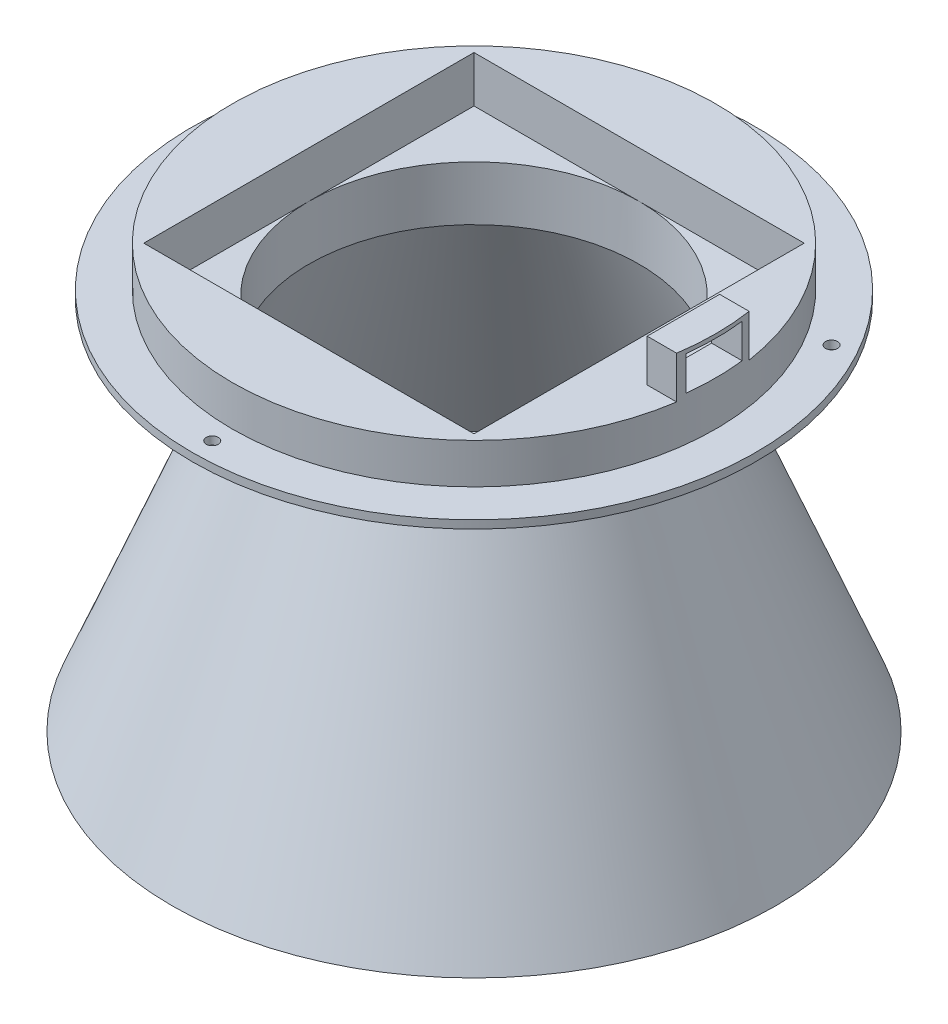
ISO-10303-21;
HEADER;
FILE_DESCRIPTION(('STEP AP214'),'2;1');
FILE_NAME('part.step','',(''),(''),'','','');
FILE_SCHEMA(('AUTOMOTIVE_DESIGN { 1 0 10303 214 1 1 1 1 }'));
ENDSEC;
DATA;
#1=APPLICATION_CONTEXT('core data for automotive mechanical design processes');
#2=APPLICATION_PROTOCOL_DEFINITION('international standard','automotive_design',2000,#1);
#3=PRODUCT_CONTEXT('',#1,'mechanical');
#4=PRODUCT('Part','Part','',(#3));
#5=PRODUCT_RELATED_PRODUCT_CATEGORY('part','',(#4));
#6=PRODUCT_DEFINITION_FORMATION('','',#4);
#7=PRODUCT_DEFINITION_CONTEXT('part definition',#1,'design');
#8=PRODUCT_DEFINITION('design','',#6,#7);
#9=PRODUCT_DEFINITION_SHAPE('','',#8);
#10=(LENGTH_UNIT() NAMED_UNIT(*) SI_UNIT(.MILLI.,.METRE.));
#11=(NAMED_UNIT(*) PLANE_ANGLE_UNIT() SI_UNIT($,.RADIAN.));
#12=(NAMED_UNIT(*) SI_UNIT($,.STERADIAN.) SOLID_ANGLE_UNIT());
#13=UNCERTAINTY_MEASURE_WITH_UNIT(LENGTH_MEASURE(1.E-05),#10,'distance_accuracy_value','');
#14=(GEOMETRIC_REPRESENTATION_CONTEXT(3) GLOBAL_UNCERTAINTY_ASSIGNED_CONTEXT((#13)) GLOBAL_UNIT_ASSIGNED_CONTEXT((#10,
#11,#12)) REPRESENTATION_CONTEXT('',''));
#15=CARTESIAN_POINT('',(0.,0.,0.));
#16=DIRECTION('',(0.,0.,1.));
#17=DIRECTION('',(1.,0.,0.));
#18=AXIS2_PLACEMENT_3D('',#15,#16,#17);
#19=CARTESIAN_POINT('',(-26.9016428172304,46.9761170199418,0.));
#20=DIRECTION('',(0.,1.,0.));
#21=DIRECTION('',(0.,0.,1.));
#22=AXIS2_PLACEMENT_3D('',#19,#20,#21);
#23=CYLINDRICAL_SURFACE('',#22,41.);
#24=CARTESIAN_POINT('',(-26.9016428172304,46.9761170199418,0.));
#25=DIRECTION('',(0.,1.,0.));
#26=DIRECTION('',(0.,0.,1.));
#27=AXIS2_PLACEMENT_3D('',#24,#25,#26);
#28=CIRCLE('',#27,41.);
#29=CARTESIAN_POINT('',(-26.9016428172304,46.9761170199418,41.));
#30=VERTEX_POINT('',#29);
#31=EDGE_CURVE('E224',#30,#30,#28,.T.);
#32=ORIENTED_EDGE('',*,*,#31,.F.);
#33=EDGE_LOOP('',(#32));
#34=FACE_BOUND('',#33,.T.);
#35=CARTESIAN_POINT('',(-26.9016428172304,60.4761170199418,0.));
#36=DIRECTION('',(0.,1.,0.));
#37=DIRECTION('',(0.,0.,1.));
#38=AXIS2_PLACEMENT_3D('',#35,#36,#37);
#39=CIRCLE('',#38,41.);
#40=CARTESIAN_POINT('',(-67.9016428172304,60.4761170199418,0.));
#41=VERTEX_POINT('',#40);
#42=CARTESIAN_POINT('',(-26.9016428172304,60.4761170199418,41.));
#43=VERTEX_POINT('',#42);
#44=EDGE_CURVE('E44',#41,#43,#39,.T.);
#45=ORIENTED_EDGE('',*,*,#44,.T.);
#46=CARTESIAN_POINT('',(14.0983571827696,60.4761170199418,0.));
#47=VERTEX_POINT('',#46);
#48=EDGE_CURVE('E11',#43,#47,#39,.T.);
#49=ORIENTED_EDGE('',*,*,#48,.T.);
#50=CARTESIAN_POINT('',(-26.9016428172304,60.4761170199418,-41.));
#51=VERTEX_POINT('',#50);
#52=EDGE_CURVE('E42',#47,#51,#39,.T.);
#53=ORIENTED_EDGE('',*,*,#52,.T.);
#54=EDGE_CURVE('E257',#51,#41,#39,.T.);
#55=ORIENTED_EDGE('',*,*,#54,.T.);
#56=EDGE_LOOP('',(#45,#49,#53,#55));
#57=FACE_BOUND('',#56,.T.);
#58=ADVANCED_FACE('F33',(#34,#57),#23,.F.);
#59=CARTESIAN_POINT('',(-26.9016428172304,-33.0238829800582,0.));
#60=DIRECTION('',(0.,-1.,0.));
#61=DIRECTION('',(0.,0.,-1.));
#62=AXIS2_PLACEMENT_3D('',#59,#60,#61);
#63=CONICAL_SURFACE('',#62,73.,0.380506377112365);
#64=ORIENTED_EDGE('',*,*,#31,.T.);
#65=EDGE_LOOP('',(#64));
#66=FACE_BOUND('',#65,.T.);
#67=CARTESIAN_POINT('',(-26.9016428172304,-33.0238829800582,0.));
#68=DIRECTION('',(0.,1.,0.));
#69=DIRECTION('',(0.,0.,1.));
#70=AXIS2_PLACEMENT_3D('',#67,#68,#69);
#71=CIRCLE('',#70,73.);
#72=CARTESIAN_POINT('',(-26.9016428172304,-33.0238829800582,73.));
#73=VERTEX_POINT('',#72);
#74=EDGE_CURVE('E254',#73,#73,#71,.T.);
#75=ORIENTED_EDGE('',*,*,#74,.F.);
#76=EDGE_LOOP('',(#75));
#77=FACE_BOUND('',#76,.T.);
#78=ADVANCED_FACE('F35',(#66,#77),#63,.F.);
#79=CARTESIAN_POINT('',(-101.90164281723,-33.0238829800582,0.));
#80=DIRECTION('',(0.,-1.,0.));
#81=DIRECTION('',(0.,0.,-1.));
#82=AXIS2_PLACEMENT_3D('',#79,#80,#81);
#83=PLANE('',#82);
#84=ORIENTED_EDGE('',*,*,#74,.T.);
#85=EDGE_LOOP('',(#84));
#86=FACE_BOUND('',#85,.T.);
#87=CARTESIAN_POINT('',(-26.9016428172304,-33.0238829800582,0.));
#88=DIRECTION('',(0.,1.,0.));
#89=DIRECTION('',(0.,0.,1.));
#90=AXIS2_PLACEMENT_3D('',#87,#88,#89);
#91=CIRCLE('',#90,75.);
#92=CARTESIAN_POINT('',(-26.9016428172304,-33.0238829800582,75.));
#93=VERTEX_POINT('',#92);
#94=EDGE_CURVE('E251',#93,#93,#91,.T.);
#95=ORIENTED_EDGE('',*,*,#94,.F.);
#96=EDGE_LOOP('',(#95));
#97=FACE_BOUND('',#96,.T.);
#98=ADVANCED_FACE('F342',(#86,#97),#83,.T.);
#99=CARTESIAN_POINT('',(-26.9016428172304,46.9761170199418,0.));
#100=DIRECTION('',(0.,-1.,0.));
#101=DIRECTION('',(0.,0.,-1.));
#102=AXIS2_PLACEMENT_3D('',#99,#100,#101);
#103=CONICAL_SURFACE('',#102,43.,0.380506377112365);
#104=ORIENTED_EDGE('',*,*,#94,.T.);
#105=EDGE_LOOP('',(#104));
#106=FACE_BOUND('',#105,.T.);
#107=CARTESIAN_POINT('',(-26.9016428172304,46.9761170199418,0.));
#108=DIRECTION('',(0.,1.,0.));
#109=DIRECTION('',(0.,0.,1.));
#110=AXIS2_PLACEMENT_3D('',#107,#108,#109);
#111=CIRCLE('',#110,43.);
#112=CARTESIAN_POINT('',(-26.9016428172304,46.9761170199418,43.));
#113=VERTEX_POINT('',#112);
#114=EDGE_CURVE('E248',#113,#113,#111,.T.);
#115=ORIENTED_EDGE('',*,*,#114,.F.);
#116=EDGE_LOOP('',(#115));
#117=FACE_BOUND('',#116,.T.);
#118=ADVANCED_FACE('F366',(#106,#117),#103,.T.);
#119=CARTESIAN_POINT('',(-26.9016428172304,59.9761170199418,0.));
#120=DIRECTION('',(0.,1.,0.));
#121=DIRECTION('',(0.,0.,1.));
#122=AXIS2_PLACEMENT_3D('',#119,#120,#121);
#123=CONICAL_SURFACE('',#122,60.,0.917949695694122);
#124=ORIENTED_EDGE('',*,*,#114,.T.);
#125=EDGE_LOOP('',(#124));
#126=FACE_BOUND('',#125,.T.);
#127=CARTESIAN_POINT('',(-26.9016428172304,59.9761170199418,0.));
#128=DIRECTION('',(0.,1.,0.));
#129=DIRECTION('',(0.,0.,1.));
#130=AXIS2_PLACEMENT_3D('',#127,#128,#129);
#131=CIRCLE('',#130,60.);
#132=CARTESIAN_POINT('',(-26.9016428172304,59.9761170199418,60.));
#133=VERTEX_POINT('',#132);
#134=EDGE_CURVE('E245',#133,#133,#131,.T.);
#135=ORIENTED_EDGE('',*,*,#134,.F.);
#136=EDGE_LOOP('',(#135));
#137=FACE_BOUND('',#136,.T.);
#138=ADVANCED_FACE('F362',(#126,#137),#123,.T.);
#139=CARTESIAN_POINT('',(-96.9016428172304,59.9761170199418,0.));
#140=DIRECTION('',(0.,-1.,0.));
#141=DIRECTION('',(0.,0.,-1.));
#142=AXIS2_PLACEMENT_3D('',#139,#140,#141);
#143=PLANE('',#142);
#144=CARTESIAN_POINT('',(29.3900084287585,59.9761170199418,-32.4999999999995));
#145=DIRECTION('',(0.,-1.,0.));
#146=DIRECTION('',(0.,0.,-1.));
#147=AXIS2_PLACEMENT_3D('',#144,#145,#146);
#148=CIRCLE('',#147,1.5);
#149=CARTESIAN_POINT('',(29.3900084287585,59.9761170199418,-33.9999999999995));
#150=VERTEX_POINT('',#149);
#151=EDGE_CURVE('E559',#150,#150,#148,.T.);
#152=ORIENTED_EDGE('',*,*,#151,.F.);
#153=EDGE_LOOP('',(#152));
#154=FACE_BOUND('',#153,.T.);
#155=CARTESIAN_POINT('',(-83.1932940632187,59.9761170199418,-32.5000000000002));
#156=DIRECTION('',(0.,-1.,0.));
#157=DIRECTION('',(0.,0.,-1.));
#158=AXIS2_PLACEMENT_3D('',#155,#156,#157);
#159=CIRCLE('',#158,1.5);
#160=CARTESIAN_POINT('',(-83.1932940632187,59.9761170199418,-34.0000000000003));
#161=VERTEX_POINT('',#160);
#162=EDGE_CURVE('E569',#161,#161,#159,.T.);
#163=ORIENTED_EDGE('',*,*,#162,.F.);
#164=EDGE_LOOP('',(#163));
#165=FACE_BOUND('',#164,.T.);
#166=CARTESIAN_POINT('',(-26.9016428172304,59.9761170199418,65.));
#167=DIRECTION('',(0.,-1.,0.));
#168=DIRECTION('',(0.,0.,-1.));
#169=AXIS2_PLACEMENT_3D('',#166,#167,#168);
#170=CIRCLE('',#169,1.5);
#171=CARTESIAN_POINT('',(-26.9016428172304,59.9761170199418,63.5));
#172=VERTEX_POINT('',#171);
#173=EDGE_CURVE('E575',#172,#172,#170,.T.);
#174=ORIENTED_EDGE('',*,*,#173,.F.);
#175=EDGE_LOOP('',(#174));
#176=FACE_BOUND('',#175,.T.);
#177=ORIENTED_EDGE('',*,*,#134,.T.);
#178=EDGE_LOOP('',(#177));
#179=FACE_BOUND('',#178,.T.);
#180=CARTESIAN_POINT('',(-26.9016428172304,59.9761170199418,0.));
#181=DIRECTION('',(0.,1.,0.));
#182=DIRECTION('',(0.,0.,1.));
#183=AXIS2_PLACEMENT_3D('',#180,#181,#182);
#184=CIRCLE('',#183,70.);
#185=CARTESIAN_POINT('',(-26.9016428172304,59.9761170199418,70.));
#186=VERTEX_POINT('',#185);
#187=EDGE_CURVE('E242',#186,#186,#184,.T.);
#188=ORIENTED_EDGE('',*,*,#187,.F.);
#189=EDGE_LOOP('',(#188));
#190=FACE_BOUND('',#189,.T.);
#191=ADVANCED_FACE('F358',(#154,#165,#176,#179,#190),#143,.T.);
#192=CARTESIAN_POINT('',(-26.9016428172304,46.9761170199418,0.));
#193=DIRECTION('',(0.,1.,0.));
#194=DIRECTION('',(0.,0.,1.));
#195=AXIS2_PLACEMENT_3D('',#192,#193,#194);
#196=CYLINDRICAL_SURFACE('',#195,70.);
#197=ORIENTED_EDGE('',*,*,#187,.T.);
#198=EDGE_LOOP('',(#197));
#199=FACE_BOUND('',#198,.T.);
#200=CARTESIAN_POINT('',(-26.9016428172304,61.9761170199418,0.));
#201=DIRECTION('',(0.,1.,0.));
#202=DIRECTION('',(0.,0.,1.));
#203=AXIS2_PLACEMENT_3D('',#200,#201,#202);
#204=CIRCLE('',#203,70.);
#205=CARTESIAN_POINT('',(-26.9016428172304,61.9761170199418,70.));
#206=VERTEX_POINT('',#205);
#207=EDGE_CURVE('E226',#206,#206,#204,.T.);
#208=ORIENTED_EDGE('',*,*,#207,.F.);
#209=EDGE_LOOP('',(#208));
#210=FACE_BOUND('',#209,.T.);
#211=ADVANCED_FACE('F354',(#199,#210),#196,.T.);
#212=CARTESIAN_POINT('',(-86.9016428172304,61.9761170199418,0.));
#213=DIRECTION('',(0.,1.,0.));
#214=DIRECTION('',(0.,0.,1.));
#215=AXIS2_PLACEMENT_3D('',#212,#213,#214);
#216=PLANE('',#215);
#217=CARTESIAN_POINT('',(29.3900084287585,61.9761170199418,-32.4999999999995));
#218=DIRECTION('',(0.,1.,0.));
#219=DIRECTION('',(0.,0.,1.));
#220=AXIS2_PLACEMENT_3D('',#217,#218,#219);
#221=CIRCLE('',#220,1.5);
#222=CARTESIAN_POINT('',(29.3900084287585,61.9761170199418,-30.9999999999995));
#223=VERTEX_POINT('',#222);
#224=EDGE_CURVE('E562',#223,#223,#221,.T.);
#225=ORIENTED_EDGE('',*,*,#224,.F.);
#226=EDGE_LOOP('',(#225));
#227=FACE_BOUND('',#226,.T.);
#228=CARTESIAN_POINT('',(-83.1932940632187,61.9761170199418,-32.5000000000002));
#229=DIRECTION('',(0.,1.,0.));
#230=DIRECTION('',(0.,0.,1.));
#231=AXIS2_PLACEMENT_3D('',#228,#229,#230);
#232=CIRCLE('',#231,1.5);
#233=CARTESIAN_POINT('',(-83.1932940632187,61.9761170199418,-31.0000000000002));
#234=VERTEX_POINT('',#233);
#235=EDGE_CURVE('E564',#234,#234,#232,.T.);
#236=ORIENTED_EDGE('',*,*,#235,.F.);
#237=EDGE_LOOP('',(#236));
#238=FACE_BOUND('',#237,.T.);
#239=CARTESIAN_POINT('',(-26.9016428172304,61.9761170199418,65.));
#240=DIRECTION('',(0.,1.,0.));
#241=DIRECTION('',(0.,0.,1.));
#242=AXIS2_PLACEMENT_3D('',#239,#240,#241);
#243=CIRCLE('',#242,1.5);
#244=CARTESIAN_POINT('',(-26.9016428172304,61.9761170199418,66.5));
#245=VERTEX_POINT('',#244);
#246=EDGE_CURVE('E572',#245,#245,#243,.T.);
#247=ORIENTED_EDGE('',*,*,#246,.F.);
#248=EDGE_LOOP('',(#247));
#249=FACE_BOUND('',#248,.T.);
#250=ORIENTED_EDGE('',*,*,#207,.T.);
#251=EDGE_LOOP('',(#250));
#252=FACE_BOUND('',#251,.T.);
#253=CARTESIAN_POINT('',(-26.9016428172304,61.9761170199418,0.));
#254=DIRECTION('',(0.,1.,0.));
#255=DIRECTION('',(0.,0.,1.));
#256=AXIS2_PLACEMENT_3D('',#253,#254,#255);
#257=CIRCLE('',#256,60.);
#258=CARTESIAN_POINT('',(-26.9016428172304,61.9761170199418,60.));
#259=VERTEX_POINT('',#258);
#260=EDGE_CURVE('E223',#259,#259,#257,.T.);
#261=ORIENTED_EDGE('',*,*,#260,.F.);
#262=EDGE_LOOP('',(#261));
#263=FACE_BOUND('',#262,.T.);
#264=ADVANCED_FACE('F350',(#227,#238,#249,#252,#263),#216,.T.);
#265=CARTESIAN_POINT('',(-26.9016428172304,46.9761170199418,0.));
#266=DIRECTION('',(0.,1.,0.));
#267=DIRECTION('',(0.,0.,1.));
#268=AXIS2_PLACEMENT_3D('',#265,#266,#267);
#269=CYLINDRICAL_SURFACE('',#268,60.);
#270=DIRECTION('',(0.,1.,0.));
#271=VECTOR('',#270,1.);
#272=CARTESIAN_POINT('',(32.688624844528,46.9761170199418,6.99999999999999));
#273=LINE('',#272,#271);
#274=CARTESIAN_POINT('',(32.688624844528,81.4761170199418,6.99999999999998));
#275=VERTEX_POINT('',#274);
#276=CARTESIAN_POINT('',(32.688624844528,72.9761170199418,6.99999999999998));
#277=VERTEX_POINT('',#276);
#278=EDGE_CURVE('E170',#275,#277,#273,.F.);
#279=ORIENTED_EDGE('',*,*,#278,.F.);
#280=CARTESIAN_POINT('',(-26.9016428172304,81.4761170199418,0.));
#281=DIRECTION('',(0.,1.,0.));
#282=DIRECTION('',(0.,0.,1.));
#283=AXIS2_PLACEMENT_3D('',#280,#281,#282);
#284=CIRCLE('',#283,60.);
#285=CARTESIAN_POINT('',(32.688624844528,81.4761170199418,-7.00000000000001));
#286=VERTEX_POINT('',#285);
#287=EDGE_CURVE('E163',#286,#275,#284,.F.);
#288=ORIENTED_EDGE('',*,*,#287,.F.);
#289=DIRECTION('',(0.,1.,0.));
#290=VECTOR('',#289,1.);
#291=CARTESIAN_POINT('',(32.688624844528,46.9761170199418,-7.00000000000001));
#292=LINE('',#291,#290);
#293=CARTESIAN_POINT('',(32.688624844528,72.9761170199418,-7.00000000000002));
#294=VERTEX_POINT('',#293);
#295=EDGE_CURVE('E143',#294,#286,#292,.T.);
#296=ORIENTED_EDGE('',*,*,#295,.F.);
#297=CARTESIAN_POINT('',(-26.9016428172304,72.9761170199418,0.));
#298=DIRECTION('',(0.,-1.,0.));
#299=DIRECTION('',(0.,0.,-1.));
#300=AXIS2_PLACEMENT_3D('',#297,#298,#299);
#301=CIRCLE('',#300,60.);
#302=EDGE_CURVE('E168',#277,#294,#301,.F.);
#303=ORIENTED_EDGE('',*,*,#302,.F.);
#304=EDGE_LOOP('',(#279,#288,#296,#303));
#305=FACE_BOUND('',#304,.T.);
#306=ORIENTED_EDGE('',*,*,#260,.T.);
#307=EDGE_LOOP('',(#306));
#308=FACE_BOUND('',#307,.T.);
#309=CARTESIAN_POINT('',(-26.9016428172304,71.9761170199418,0.));
#310=DIRECTION('',(0.,1.,0.));
#311=DIRECTION('',(0.,0.,1.));
#312=AXIS2_PLACEMENT_3D('',#309,#310,#311);
#313=CIRCLE('',#312,60.);
#314=CARTESIAN_POINT('',(32.4195169826252,71.9761170199418,-9.));
#315=VERTEX_POINT('',#314);
#316=CARTESIAN_POINT('',(32.4195169826252,71.9761170199418,9.));
#317=VERTEX_POINT('',#316);
#318=EDGE_CURVE('E194',#315,#317,#313,.T.);
#319=ORIENTED_EDGE('',*,*,#318,.F.);
#320=DIRECTION('',(0.,-1.,0.));
#321=VECTOR('',#320,1.);
#322=CARTESIAN_POINT('',(32.4195169826252,82.4761170199418,-9.));
#323=LINE('',#322,#321);
#324=CARTESIAN_POINT('',(32.4195169826252,82.4761170199418,-9.));
#325=VERTEX_POINT('',#324);
#326=EDGE_CURVE('E200',#325,#315,#323,.T.);
#327=ORIENTED_EDGE('',*,*,#326,.F.);
#328=CARTESIAN_POINT('',(-26.9016428172308,82.4761170199418,0.));
#329=DIRECTION('',(0.,1.,0.));
#330=DIRECTION('',(0.,0.,-1.));
#331=AXIS2_PLACEMENT_3D('',#328,#329,#330);
#332=CIRCLE('',#331,60.0000000000004);
#333=CARTESIAN_POINT('',(32.4195169826252,82.4761170199418,9.));
#334=VERTEX_POINT('',#333);
#335=EDGE_CURVE('E179',#334,#325,#332,.T.);
#336=ORIENTED_EDGE('',*,*,#335,.F.);
#337=DIRECTION('',(0.,-1.,0.));
#338=VECTOR('',#337,1.);
#339=CARTESIAN_POINT('',(32.4195169826252,82.4761170199418,9.));
#340=LINE('',#339,#338);
#341=EDGE_CURVE('E196',#334,#317,#340,.T.);
#342=ORIENTED_EDGE('',*,*,#341,.T.);
#343=EDGE_LOOP('',(#319,#327,#336,#342));
#344=FACE_BOUND('',#343,.T.);
#345=ADVANCED_FACE('F220',(#305,#308,#344),#269,.T.);
#346=CARTESIAN_POINT('',(-86.9016428172304,71.9761170199418,0.));
#347=DIRECTION('',(0.,1.,0.));
#348=DIRECTION('',(0.,0.,1.));
#349=AXIS2_PLACEMENT_3D('',#346,#347,#348);
#350=PLANE('',#349);
#351=DIRECTION('',(-1.,0.,0.));
#352=VECTOR('',#351,1.);
#353=CARTESIAN_POINT('',(32.4195169826252,71.9761170199418,-9.));
#354=LINE('',#353,#352);
#355=CARTESIAN_POINT('',(25.0983571827696,71.9761170199418,-9.));
#356=VERTEX_POINT('',#355);
#357=EDGE_CURVE('E177',#315,#356,#354,.T.);
#358=ORIENTED_EDGE('',*,*,#357,.F.);
#359=ORIENTED_EDGE('',*,*,#318,.T.);
#360=DIRECTION('',(1.,0.,0.));
#361=VECTOR('',#360,1.);
#362=CARTESIAN_POINT('',(25.0983571827696,71.9761170199418,9.));
#363=LINE('',#362,#361);
#364=CARTESIAN_POINT('',(25.0983571827696,71.9761170199418,9.));
#365=VERTEX_POINT('',#364);
#366=EDGE_CURVE('E186',#365,#317,#363,.T.);
#367=ORIENTED_EDGE('',*,*,#366,.F.);
#368=DIRECTION('',(0.,0.,1.));
#369=VECTOR('',#368,1.);
#370=CARTESIAN_POINT('',(25.0983571827696,71.9761170199418,-9.));
#371=LINE('',#370,#369);
#372=EDGE_CURVE('E172',#356,#365,#371,.T.);
#373=ORIENTED_EDGE('',*,*,#372,.F.);
#374=EDGE_LOOP('',(#358,#359,#367,#373));
#375=FACE_BOUND('',#374,.T.);
#376=DIRECTION('',(-1.,0.,0.));
#377=VECTOR('',#376,1.);
#378=CARTESIAN_POINT('',(14.0983571827696,71.9761170199418,-41.));
#379=LINE('',#378,#377);
#380=CARTESIAN_POINT('',(14.0983571827696,71.9761170199418,-41.));
#381=VERTEX_POINT('',#380);
#382=CARTESIAN_POINT('',(-67.9016428172304,71.9761170199418,-41.));
#383=VERTEX_POINT('',#382);
#384=EDGE_CURVE('E296',#381,#383,#379,.T.);
#385=ORIENTED_EDGE('',*,*,#384,.F.);
#386=DIRECTION('',(0.,0.,-1.));
#387=VECTOR('',#386,1.);
#388=CARTESIAN_POINT('',(14.0983571827696,71.9761170199418,41.));
#389=LINE('',#388,#387);
#390=CARTESIAN_POINT('',(14.0983571827696,71.9761170199418,41.));
#391=VERTEX_POINT('',#390);
#392=EDGE_CURVE('E294',#391,#381,#389,.T.);
#393=ORIENTED_EDGE('',*,*,#392,.F.);
#394=DIRECTION('',(1.,0.,0.));
#395=VECTOR('',#394,1.);
#396=CARTESIAN_POINT('',(14.0983571827696,71.9761170199418,41.));
#397=LINE('',#396,#395);
#398=CARTESIAN_POINT('',(-67.9016428172304,71.9761170199418,41.));
#399=VERTEX_POINT('',#398);
#400=EDGE_CURVE('E292',#399,#391,#397,.T.);
#401=ORIENTED_EDGE('',*,*,#400,.F.);
#402=DIRECTION('',(0.,0.,1.));
#403=VECTOR('',#402,1.);
#404=CARTESIAN_POINT('',(-67.9016428172304,71.9761170199418,41.));
#405=LINE('',#404,#403);
#406=EDGE_CURVE('E290',#383,#399,#405,.T.);
#407=ORIENTED_EDGE('',*,*,#406,.F.);
#408=EDGE_LOOP('',(#385,#393,#401,#407));
#409=FACE_BOUND('',#408,.T.);
#410=ADVANCED_FACE('F217',(#375,#409),#350,.T.);
#411=CARTESIAN_POINT('',(-67.9016428172304,60.4761170199418,41.));
#412=DIRECTION('',(-1.,0.,0.));
#413=DIRECTION('',(0.,0.,1.));
#414=AXIS2_PLACEMENT_3D('',#411,#412,#413);
#415=PLANE('',#414);
#416=DIRECTION('',(0.,0.,1.));
#417=VECTOR('',#416,1.);
#418=CARTESIAN_POINT('',(-67.9016428172304,60.4761170199418,41.));
#419=LINE('',#418,#417);
#420=CARTESIAN_POINT('',(-67.9016428172304,60.4761170199418,-41.));
#421=VERTEX_POINT('',#420);
#422=EDGE_CURVE('E320',#421,#41,#419,.T.);
#423=ORIENTED_EDGE('',*,*,#422,.F.);
#424=DIRECTION('',(0.,1.,0.));
#425=VECTOR('',#424,1.);
#426=CARTESIAN_POINT('',(-67.9016428172304,60.4761170199418,-41.));
#427=LINE('',#426,#425);
#428=EDGE_CURVE('E229',#421,#383,#427,.T.);
#429=ORIENTED_EDGE('',*,*,#428,.T.);
#430=ORIENTED_EDGE('',*,*,#406,.T.);
#431=DIRECTION('',(0.,1.,0.));
#432=VECTOR('',#431,1.);
#433=CARTESIAN_POINT('',(-67.9016428172304,60.4761170199418,41.));
#434=LINE('',#433,#432);
#435=CARTESIAN_POINT('',(-67.9016428172304,60.4761170199418,41.));
#436=VERTEX_POINT('',#435);
#437=EDGE_CURVE('E237',#436,#399,#434,.T.);
#438=ORIENTED_EDGE('',*,*,#437,.F.);
#439=EDGE_CURVE('E297',#41,#436,#419,.T.);
#440=ORIENTED_EDGE('',*,*,#439,.F.);
#441=EDGE_LOOP('',(#423,#429,#430,#438,#440));
#442=FACE_BOUND('',#441,.T.);
#443=ADVANCED_FACE('F310',(#442),#415,.F.);
#444=CARTESIAN_POINT('',(14.0983571827696,60.4761170199418,-41.));
#445=DIRECTION('',(0.,0.,-1.));
#446=DIRECTION('',(-1.,0.,0.));
#447=AXIS2_PLACEMENT_3D('',#444,#445,#446);
#448=PLANE('',#447);
#449=DIRECTION('',(-1.,0.,0.));
#450=VECTOR('',#449,1.);
#451=CARTESIAN_POINT('',(14.0983571827696,60.4761170199418,-41.));
#452=LINE('',#451,#450);
#453=CARTESIAN_POINT('',(14.0983571827696,60.4761170199418,-41.));
#454=VERTEX_POINT('',#453);
#455=EDGE_CURVE('E270',#454,#51,#452,.T.);
#456=ORIENTED_EDGE('',*,*,#455,.F.);
#457=DIRECTION('',(0.,1.,0.));
#458=VECTOR('',#457,1.);
#459=CARTESIAN_POINT('',(14.0983571827696,60.4761170199418,-41.));
#460=LINE('',#459,#458);
#461=EDGE_CURVE('E234',#454,#381,#460,.T.);
#462=ORIENTED_EDGE('',*,*,#461,.T.);
#463=ORIENTED_EDGE('',*,*,#384,.T.);
#464=ORIENTED_EDGE('',*,*,#428,.F.);
#465=EDGE_CURVE('E285',#51,#421,#452,.T.);
#466=ORIENTED_EDGE('',*,*,#465,.F.);
#467=EDGE_LOOP('',(#456,#462,#463,#464,#466));
#468=FACE_BOUND('',#467,.T.);
#469=ADVANCED_FACE('F316',(#468),#448,.F.);
#470=CARTESIAN_POINT('',(14.0983571827696,60.4761170199418,41.));
#471=DIRECTION('',(1.,0.,0.));
#472=DIRECTION('',(0.,0.,-1.));
#473=AXIS2_PLACEMENT_3D('',#470,#471,#472);
#474=PLANE('',#473);
#475=DIRECTION('',(0.,0.,-1.));
#476=VECTOR('',#475,1.);
#477=CARTESIAN_POINT('',(14.0983571827696,60.4761170199418,41.));
#478=LINE('',#477,#476);
#479=CARTESIAN_POINT('',(14.0983571827696,60.4761170199418,41.));
#480=VERTEX_POINT('',#479);
#481=EDGE_CURVE('E276',#480,#47,#478,.T.);
#482=ORIENTED_EDGE('',*,*,#481,.F.);
#483=DIRECTION('',(0.,1.,0.));
#484=VECTOR('',#483,1.);
#485=CARTESIAN_POINT('',(14.0983571827696,60.4761170199418,41.));
#486=LINE('',#485,#484);
#487=EDGE_CURVE('E299',#480,#391,#486,.T.);
#488=ORIENTED_EDGE('',*,*,#487,.T.);
#489=ORIENTED_EDGE('',*,*,#392,.T.);
#490=ORIENTED_EDGE('',*,*,#461,.F.);
#491=EDGE_CURVE('E267',#47,#454,#478,.T.);
#492=ORIENTED_EDGE('',*,*,#491,.F.);
#493=EDGE_LOOP('',(#482,#488,#489,#490,#492));
#494=FACE_BOUND('',#493,.T.);
#495=ADVANCED_FACE('F274',(#494),#474,.F.);
#496=CARTESIAN_POINT('',(14.0983571827696,60.4761170199418,41.));
#497=DIRECTION('',(0.,0.,1.));
#498=DIRECTION('',(1.,0.,0.));
#499=AXIS2_PLACEMENT_3D('',#496,#497,#498);
#500=PLANE('',#499);
#501=DIRECTION('',(1.,0.,0.));
#502=VECTOR('',#501,1.);
#503=CARTESIAN_POINT('',(14.0983571827696,60.4761170199418,41.));
#504=LINE('',#503,#502);
#505=EDGE_CURVE('E278',#436,#43,#504,.T.);
#506=ORIENTED_EDGE('',*,*,#505,.F.);
#507=ORIENTED_EDGE('',*,*,#437,.T.);
#508=ORIENTED_EDGE('',*,*,#400,.T.);
#509=ORIENTED_EDGE('',*,*,#487,.F.);
#510=EDGE_CURVE('E283',#43,#480,#504,.T.);
#511=ORIENTED_EDGE('',*,*,#510,.F.);
#512=EDGE_LOOP('',(#506,#507,#508,#509,#511));
#513=FACE_BOUND('',#512,.T.);
#514=ADVANCED_FACE('F305',(#513),#500,.F.);
#515=CARTESIAN_POINT('',(0.,60.4761170199418,0.));
#516=DIRECTION('',(0.,1.,0.));
#517=DIRECTION('',(0.,0.,1.));
#518=AXIS2_PLACEMENT_3D('',#515,#516,#517);
#519=PLANE('',#518);
#520=ORIENTED_EDGE('',*,*,#510,.T.);
#521=ORIENTED_EDGE('',*,*,#481,.T.);
#522=ORIENTED_EDGE('',*,*,#48,.F.);
#523=EDGE_LOOP('',(#520,#521,#522));
#524=FACE_BOUND('',#523,.T.);
#525=ADVANCED_FACE('F281',(#524),#519,.T.);
#526=ORIENTED_EDGE('',*,*,#491,.T.);
#527=ORIENTED_EDGE('',*,*,#455,.T.);
#528=ORIENTED_EDGE('',*,*,#52,.F.);
#529=EDGE_LOOP('',(#526,#527,#528));
#530=FACE_BOUND('',#529,.T.);
#531=ADVANCED_FACE('F266',(#530),#519,.T.);
#532=ORIENTED_EDGE('',*,*,#465,.T.);
#533=ORIENTED_EDGE('',*,*,#422,.T.);
#534=ORIENTED_EDGE('',*,*,#54,.F.);
#535=EDGE_LOOP('',(#532,#533,#534));
#536=FACE_BOUND('',#535,.T.);
#537=ADVANCED_FACE('F319',(#536),#519,.T.);
#538=ORIENTED_EDGE('',*,*,#439,.T.);
#539=ORIENTED_EDGE('',*,*,#505,.T.);
#540=ORIENTED_EDGE('',*,*,#44,.F.);
#541=EDGE_LOOP('',(#538,#539,#540));
#542=FACE_BOUND('',#541,.T.);
#543=ADVANCED_FACE('F460',(#542),#519,.T.);
#544=CARTESIAN_POINT('',(25.0983571827696,82.4761170199418,-9.));
#545=DIRECTION('',(1.,0.,0.));
#546=DIRECTION('',(0.,0.,-1.));
#547=AXIS2_PLACEMENT_3D('',#544,#545,#546);
#548=PLANE('',#547);
#549=DIRECTION('',(0.,0.,-1.));
#550=VECTOR('',#549,1.);
#551=CARTESIAN_POINT('',(25.0983571827696,81.4761170199418,-7.00000000000002));
#552=LINE('',#551,#550);
#553=CARTESIAN_POINT('',(25.0983571827696,81.4761170199418,6.99999999999998));
#554=VERTEX_POINT('',#553);
#555=CARTESIAN_POINT('',(25.0983571827696,81.4761170199418,-7.00000000000002));
#556=VERTEX_POINT('',#555);
#557=EDGE_CURVE('E149',#554,#556,#552,.T.);
#558=ORIENTED_EDGE('',*,*,#557,.F.);
#559=DIRECTION('',(0.,1.,0.));
#560=VECTOR('',#559,1.);
#561=CARTESIAN_POINT('',(25.0983571827696,81.4761170199418,6.99999999999998));
#562=LINE('',#561,#560);
#563=CARTESIAN_POINT('',(25.0983571827696,72.9761170199418,6.99999999999999));
#564=VERTEX_POINT('',#563);
#565=EDGE_CURVE('E59',#564,#554,#562,.T.);
#566=ORIENTED_EDGE('',*,*,#565,.F.);
#567=DIRECTION('',(0.,0.,1.));
#568=VECTOR('',#567,1.);
#569=CARTESIAN_POINT('',(25.0983571827696,72.9761170199418,-7.00000000000002));
#570=LINE('',#569,#568);
#571=CARTESIAN_POINT('',(25.0983571827696,72.9761170199418,-7.00000000000002));
#572=VERTEX_POINT('',#571);
#573=EDGE_CURVE('E156',#572,#564,#570,.T.);
#574=ORIENTED_EDGE('',*,*,#573,.F.);
#575=DIRECTION('',(0.,-1.,0.));
#576=VECTOR('',#575,1.);
#577=CARTESIAN_POINT('',(25.0983571827696,81.4761170199418,-7.00000000000002));
#578=LINE('',#577,#576);
#579=EDGE_CURVE('E140',#556,#572,#578,.T.);
#580=ORIENTED_EDGE('',*,*,#579,.F.);
#581=EDGE_LOOP('',(#558,#566,#574,#580));
#582=FACE_BOUND('',#581,.T.);
#583=ORIENTED_EDGE('',*,*,#372,.T.);
#584=DIRECTION('',(0.,-1.,0.));
#585=VECTOR('',#584,1.);
#586=CARTESIAN_POINT('',(25.0983571827696,82.4761170199418,9.));
#587=LINE('',#586,#585);
#588=CARTESIAN_POINT('',(25.0983571827696,82.4761170199418,9.));
#589=VERTEX_POINT('',#588);
#590=EDGE_CURVE('E199',#589,#365,#587,.T.);
#591=ORIENTED_EDGE('',*,*,#590,.F.);
#592=DIRECTION('',(0.,0.,1.));
#593=VECTOR('',#592,1.);
#594=CARTESIAN_POINT('',(25.0983571827696,82.4761170199418,-9.));
#595=LINE('',#594,#593);
#596=CARTESIAN_POINT('',(25.0983571827696,82.4761170199418,-9.));
#597=VERTEX_POINT('',#596);
#598=EDGE_CURVE('E173',#597,#589,#595,.T.);
#599=ORIENTED_EDGE('',*,*,#598,.F.);
#600=DIRECTION('',(0.,-1.,0.));
#601=VECTOR('',#600,1.);
#602=CARTESIAN_POINT('',(25.0983571827696,82.4761170199418,-9.));
#603=LINE('',#602,#601);
#604=EDGE_CURVE('E183',#597,#356,#603,.T.);
#605=ORIENTED_EDGE('',*,*,#604,.T.);
#606=EDGE_LOOP('',(#583,#591,#599,#605));
#607=FACE_BOUND('',#606,.T.);
#608=ADVANCED_FACE('F153',(#582,#607),#548,.F.);
#609=CARTESIAN_POINT('',(25.0983571827696,82.4761170199418,9.));
#610=DIRECTION('',(0.,0.,-1.));
#611=DIRECTION('',(-1.,0.,0.));
#612=AXIS2_PLACEMENT_3D('',#609,#610,#611);
#613=PLANE('',#612);
#614=ORIENTED_EDGE('',*,*,#366,.T.);
#615=ORIENTED_EDGE('',*,*,#341,.F.);
#616=DIRECTION('',(1.,0.,0.));
#617=VECTOR('',#616,1.);
#618=CARTESIAN_POINT('',(25.0983571827696,82.4761170199418,9.));
#619=LINE('',#618,#617);
#620=EDGE_CURVE('E176',#589,#334,#619,.T.);
#621=ORIENTED_EDGE('',*,*,#620,.F.);
#622=ORIENTED_EDGE('',*,*,#590,.T.);
#623=EDGE_LOOP('',(#614,#615,#621,#622));
#624=FACE_BOUND('',#623,.T.);
#625=ADVANCED_FACE('F323',(#624),#613,.F.);
#626=CARTESIAN_POINT('',(32.4195169826252,82.4761170199418,-9.));
#627=DIRECTION('',(0.,0.,1.));
#628=DIRECTION('',(1.,0.,0.));
#629=AXIS2_PLACEMENT_3D('',#626,#627,#628);
#630=PLANE('',#629);
#631=ORIENTED_EDGE('',*,*,#357,.T.);
#632=ORIENTED_EDGE('',*,*,#604,.F.);
#633=DIRECTION('',(-1.,0.,0.));
#634=VECTOR('',#633,1.);
#635=CARTESIAN_POINT('',(32.4195169826252,82.4761170199418,-9.));
#636=LINE('',#635,#634);
#637=EDGE_CURVE('E181',#325,#597,#636,.T.);
#638=ORIENTED_EDGE('',*,*,#637,.F.);
#639=ORIENTED_EDGE('',*,*,#326,.T.);
#640=EDGE_LOOP('',(#631,#632,#638,#639));
#641=FACE_BOUND('',#640,.T.);
#642=ADVANCED_FACE('F214',(#641),#630,.F.);
#643=CARTESIAN_POINT('',(-26.9016428172308,82.4761170199418,0.));
#644=DIRECTION('',(0.,-1.,0.));
#645=DIRECTION('',(0.,0.,-1.));
#646=AXIS2_PLACEMENT_3D('',#643,#644,#645);
#647=PLANE('',#646);
#648=ORIENTED_EDGE('',*,*,#598,.T.);
#649=ORIENTED_EDGE('',*,*,#620,.T.);
#650=ORIENTED_EDGE('',*,*,#335,.T.);
#651=ORIENTED_EDGE('',*,*,#637,.T.);
#652=EDGE_LOOP('',(#648,#649,#650,#651));
#653=FACE_BOUND('',#652,.T.);
#654=ADVANCED_FACE('F325',(#653),#647,.F.);
#655=CARTESIAN_POINT('',(35.5983571827696,81.4761170199418,6.99999999999998));
#656=DIRECTION('',(0.,0.,1.));
#657=DIRECTION('',(0.,-1.,0.));
#658=AXIS2_PLACEMENT_3D('',#655,#656,#657);
#659=PLANE('',#658);
#660=ORIENTED_EDGE('',*,*,#278,.T.);
#661=DIRECTION('',(-1.,0.,0.));
#662=VECTOR('',#661,1.);
#663=CARTESIAN_POINT('',(35.5983571827696,72.9761170199418,6.99999999999998));
#664=LINE('',#663,#662);
#665=EDGE_CURVE('E161',#277,#564,#664,.T.);
#666=ORIENTED_EDGE('',*,*,#665,.T.);
#667=ORIENTED_EDGE('',*,*,#565,.T.);
#668=DIRECTION('',(-1.,0.,0.));
#669=VECTOR('',#668,1.);
#670=CARTESIAN_POINT('',(35.5983571827696,81.4761170199418,6.99999999999998));
#671=LINE('',#670,#669);
#672=EDGE_CURVE('E146',#275,#554,#671,.T.);
#673=ORIENTED_EDGE('',*,*,#672,.F.);
#674=EDGE_LOOP('',(#660,#666,#667,#673));
#675=FACE_BOUND('',#674,.T.);
#676=ADVANCED_FACE('F327',(#675),#659,.F.);
#677=CARTESIAN_POINT('',(35.5983571827696,72.9761170199418,-7.00000000000002));
#678=DIRECTION('',(0.,-1.,0.));
#679=DIRECTION('',(0.,0.,-1.));
#680=AXIS2_PLACEMENT_3D('',#677,#678,#679);
#681=PLANE('',#680);
#682=ORIENTED_EDGE('',*,*,#302,.T.);
#683=DIRECTION('',(-1.,0.,0.));
#684=VECTOR('',#683,1.);
#685=CARTESIAN_POINT('',(35.5983571827696,72.9761170199418,-7.00000000000002));
#686=LINE('',#685,#684);
#687=EDGE_CURVE('E145',#294,#572,#686,.T.);
#688=ORIENTED_EDGE('',*,*,#687,.T.);
#689=ORIENTED_EDGE('',*,*,#573,.T.);
#690=ORIENTED_EDGE('',*,*,#665,.F.);
#691=EDGE_LOOP('',(#682,#688,#689,#690));
#692=FACE_BOUND('',#691,.T.);
#693=ADVANCED_FACE('F333',(#692),#681,.F.);
#694=CARTESIAN_POINT('',(35.5983571827696,81.4761170199418,-7.00000000000002));
#695=DIRECTION('',(0.,0.,-1.));
#696=DIRECTION('',(-1.,0.,0.));
#697=AXIS2_PLACEMENT_3D('',#694,#695,#696);
#698=PLANE('',#697);
#699=ORIENTED_EDGE('',*,*,#295,.T.);
#700=DIRECTION('',(-1.,0.,0.));
#701=VECTOR('',#700,1.);
#702=CARTESIAN_POINT('',(35.5983571827696,81.4761170199418,-7.00000000000002));
#703=LINE('',#702,#701);
#704=EDGE_CURVE('E51',#286,#556,#703,.T.);
#705=ORIENTED_EDGE('',*,*,#704,.T.);
#706=ORIENTED_EDGE('',*,*,#579,.T.);
#707=ORIENTED_EDGE('',*,*,#687,.F.);
#708=EDGE_LOOP('',(#699,#705,#706,#707));
#709=FACE_BOUND('',#708,.T.);
#710=ADVANCED_FACE('F137',(#709),#698,.F.);
#711=CARTESIAN_POINT('',(35.5983571827696,81.4761170199418,-7.00000000000002));
#712=DIRECTION('',(0.,1.,0.));
#713=DIRECTION('',(0.,0.,1.));
#714=AXIS2_PLACEMENT_3D('',#711,#712,#713);
#715=PLANE('',#714);
#716=ORIENTED_EDGE('',*,*,#287,.T.);
#717=ORIENTED_EDGE('',*,*,#672,.T.);
#718=ORIENTED_EDGE('',*,*,#557,.T.);
#719=ORIENTED_EDGE('',*,*,#704,.F.);
#720=EDGE_LOOP('',(#716,#717,#718,#719));
#721=FACE_BOUND('',#720,.T.);
#722=ADVANCED_FACE('F150',(#721),#715,.F.);
#723=CARTESIAN_POINT('',(-26.9016428172304,51.9761170199418,65.));
#724=DIRECTION('',(0.,1.,0.));
#725=DIRECTION('',(0.,0.,1.));
#726=AXIS2_PLACEMENT_3D('',#723,#724,#725);
#727=CYLINDRICAL_SURFACE('',#726,1.5);
#728=ORIENTED_EDGE('',*,*,#173,.T.);
#729=EDGE_LOOP('',(#728));
#730=FACE_BOUND('',#729,.T.);
#731=ORIENTED_EDGE('',*,*,#246,.T.);
#732=EDGE_LOOP('',(#731));
#733=FACE_BOUND('',#732,.T.);
#734=ADVANCED_FACE('F522',(#730,#733),#727,.F.);
#735=CARTESIAN_POINT('',(-83.1932940632187,51.9761170199418,-32.5000000000002));
#736=DIRECTION('',(0.,1.,0.));
#737=DIRECTION('',(0.,0.,1.));
#738=AXIS2_PLACEMENT_3D('',#735,#736,#737);
#739=CYLINDRICAL_SURFACE('',#738,1.5);
#740=ORIENTED_EDGE('',*,*,#162,.T.);
#741=EDGE_LOOP('',(#740));
#742=FACE_BOUND('',#741,.T.);
#743=ORIENTED_EDGE('',*,*,#235,.T.);
#744=EDGE_LOOP('',(#743));
#745=FACE_BOUND('',#744,.T.);
#746=ADVANCED_FACE('F529',(#742,#745),#739,.F.);
#747=CARTESIAN_POINT('',(29.3900084287585,51.9761170199418,-32.4999999999995));
#748=DIRECTION('',(0.,1.,0.));
#749=DIRECTION('',(0.,0.,1.));
#750=AXIS2_PLACEMENT_3D('',#747,#748,#749);
#751=CYLINDRICAL_SURFACE('',#750,1.5);
#752=ORIENTED_EDGE('',*,*,#151,.T.);
#753=EDGE_LOOP('',(#752));
#754=FACE_BOUND('',#753,.T.);
#755=ORIENTED_EDGE('',*,*,#224,.T.);
#756=EDGE_LOOP('',(#755));
#757=FACE_BOUND('',#756,.T.);
#758=ADVANCED_FACE('F538',(#754,#757),#751,.F.);
#759=CLOSED_SHELL('',(#58,#78,#98,#118,#138,#191,#211,#264,#345,#410,#443,#469,#495,#514,#525,
#531,#537,#543,#608,#625,#642,#654,#676,#693,#710,#722,#734,#746,#758));
#760=MANIFOLD_SOLID_BREP('B2',#759);
#761=ADVANCED_BREP_SHAPE_REPRESENTATION('',(#18,#760),#14);
#762=SHAPE_DEFINITION_REPRESENTATION(#9,#761);
ENDSEC;
END-ISO-10303-21;
